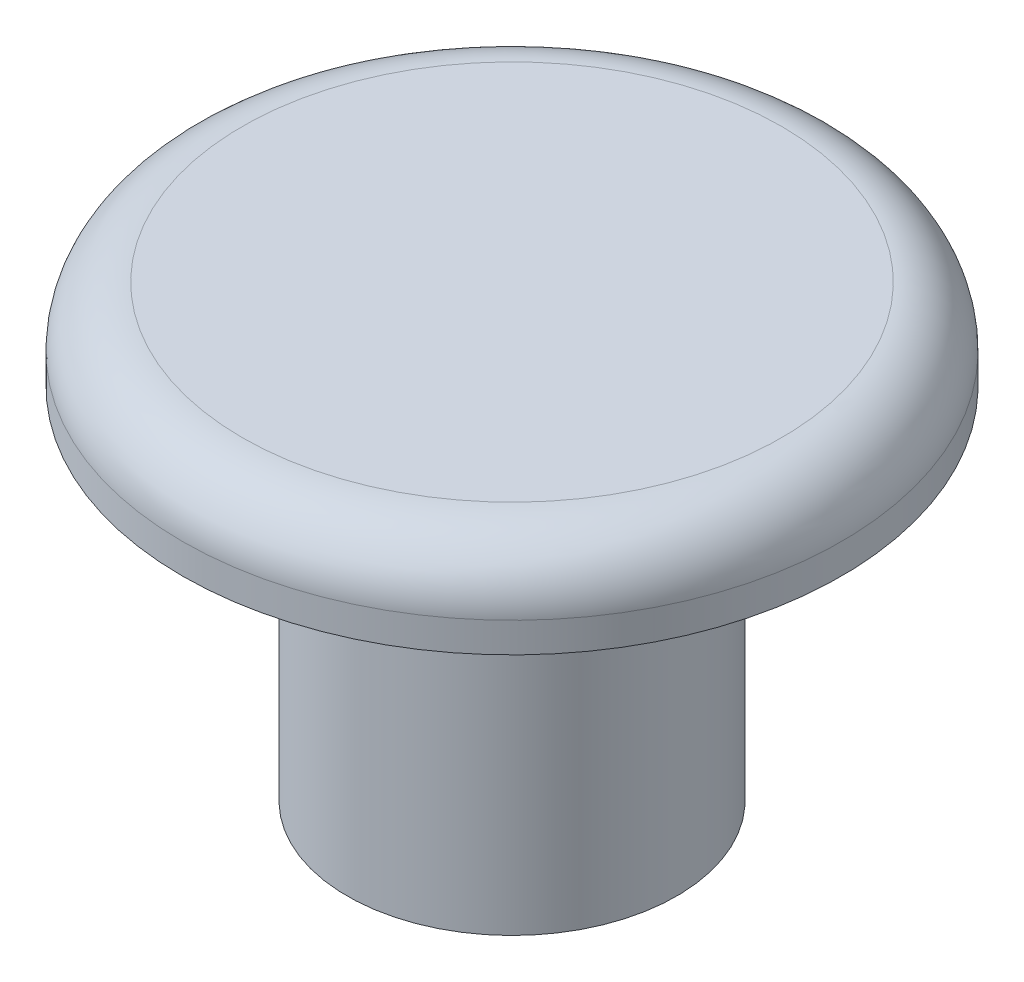
ISO-10303-21;
HEADER;
FILE_DESCRIPTION(('STEP AP214'),'2;1');
FILE_NAME('part.step','',(''),(''),'','','');
FILE_SCHEMA(('AUTOMOTIVE_DESIGN { 1 0 10303 214 1 1 1 1 }'));
ENDSEC;
DATA;
#1=APPLICATION_CONTEXT('core data for automotive mechanical design processes');
#2=APPLICATION_PROTOCOL_DEFINITION('international standard','automotive_design',2000,#1);
#3=PRODUCT_CONTEXT('',#1,'mechanical');
#4=PRODUCT('Part','Part','',(#3));
#5=PRODUCT_RELATED_PRODUCT_CATEGORY('part','',(#4));
#6=PRODUCT_DEFINITION_FORMATION('','',#4);
#7=PRODUCT_DEFINITION_CONTEXT('part definition',#1,'design');
#8=PRODUCT_DEFINITION('design','',#6,#7);
#9=PRODUCT_DEFINITION_SHAPE('','',#8);
#10=(LENGTH_UNIT() NAMED_UNIT(*) SI_UNIT(.MILLI.,.METRE.));
#11=(NAMED_UNIT(*) PLANE_ANGLE_UNIT() SI_UNIT($,.RADIAN.));
#12=(NAMED_UNIT(*) SI_UNIT($,.STERADIAN.) SOLID_ANGLE_UNIT());
#13=UNCERTAINTY_MEASURE_WITH_UNIT(LENGTH_MEASURE(1.E-05),#10,'distance_accuracy_value','');
#14=(GEOMETRIC_REPRESENTATION_CONTEXT(3) GLOBAL_UNCERTAINTY_ASSIGNED_CONTEXT((#13)) GLOBAL_UNIT_ASSIGNED_CONTEXT((#10,
#11,#12)) REPRESENTATION_CONTEXT('',''));
#15=CARTESIAN_POINT('',(0.,0.,0.));
#16=DIRECTION('',(0.,0.,1.));
#17=DIRECTION('',(1.,0.,0.));
#18=AXIS2_PLACEMENT_3D('',#15,#16,#17);
#19=CARTESIAN_POINT('',(0.,3.,0.));
#20=DIRECTION('',(0.,-1.,0.));
#21=DIRECTION('',(0.,0.,-1.));
#22=AXIS2_PLACEMENT_3D('',#19,#20,#21);
#23=CYLINDRICAL_SURFACE('',#22,11.);
#24=CARTESIAN_POINT('',(0.,1.,0.));
#25=DIRECTION('',(0.,1.,0.));
#26=DIRECTION('',(0.,0.,1.));
#27=AXIS2_PLACEMENT_3D('',#24,#25,#26);
#28=CIRCLE('',#27,11.);
#29=CARTESIAN_POINT('',(0.,1.,11.));
#30=VERTEX_POINT('',#29);
#31=EDGE_CURVE('E10',#30,#30,#28,.F.);
#32=ORIENTED_EDGE('',*,*,#31,.T.);
#33=EDGE_LOOP('',(#32));
#34=FACE_BOUND('',#33,.T.);
#35=CARTESIAN_POINT('',(0.,0.,0.));
#36=DIRECTION('',(0.,1.,0.));
#37=DIRECTION('',(0.,0.,1.));
#38=AXIS2_PLACEMENT_3D('',#35,#36,#37);
#39=CIRCLE('',#38,11.);
#40=CARTESIAN_POINT('',(0.,0.,11.));
#41=VERTEX_POINT('',#40);
#42=EDGE_CURVE('E55',#41,#41,#39,.T.);
#43=ORIENTED_EDGE('',*,*,#42,.T.);
#44=EDGE_LOOP('',(#43));
#45=FACE_BOUND('',#44,.T.);
#46=ADVANCED_FACE('F37',(#34,#45),#23,.T.);
#47=CARTESIAN_POINT('',(0.,3.,0.));
#48=DIRECTION('',(0.,1.,0.));
#49=DIRECTION('',(0.,0.,1.));
#50=AXIS2_PLACEMENT_3D('',#47,#48,#49);
#51=PLANE('',#50);
#52=CARTESIAN_POINT('',(0.,3.,0.));
#53=DIRECTION('',(0.,1.,0.));
#54=DIRECTION('',(0.,0.,1.));
#55=AXIS2_PLACEMENT_3D('',#52,#53,#54);
#56=CIRCLE('',#55,9.);
#57=CARTESIAN_POINT('',(0.,3.,9.));
#58=VERTEX_POINT('',#57);
#59=EDGE_CURVE('E45',#58,#58,#56,.T.);
#60=ORIENTED_EDGE('',*,*,#59,.T.);
#61=EDGE_LOOP('',(#60));
#62=FACE_BOUND('',#61,.T.);
#63=ADVANCED_FACE('F77',(#62),#51,.T.);
#64=CARTESIAN_POINT('',(0.,0.,0.));
#65=DIRECTION('',(0.,1.,0.));
#66=DIRECTION('',(0.,0.,1.));
#67=AXIS2_PLACEMENT_3D('',#64,#65,#66);
#68=PLANE('',#67);
#69=CARTESIAN_POINT('',(0.,0.,0.));
#70=DIRECTION('',(0.,-1.,0.));
#71=DIRECTION('',(0.,0.,-1.));
#72=AXIS2_PLACEMENT_3D('',#69,#70,#71);
#73=CIRCLE('',#72,5.5);
#74=CARTESIAN_POINT('',(0.,0.,-5.5));
#75=VERTEX_POINT('',#74);
#76=EDGE_CURVE('E50',#75,#75,#73,.T.);
#77=ORIENTED_EDGE('',*,*,#76,.F.);
#78=EDGE_LOOP('',(#77));
#79=FACE_BOUND('',#78,.T.);
#80=ORIENTED_EDGE('',*,*,#42,.F.);
#81=EDGE_LOOP('',(#80));
#82=FACE_BOUND('',#81,.T.);
#83=ADVANCED_FACE('F71',(#79,#82),#68,.F.);
#84=CARTESIAN_POINT('',(0.,-12.,0.));
#85=DIRECTION('',(0.,1.,0.));
#86=DIRECTION('',(0.,0.,1.));
#87=AXIS2_PLACEMENT_3D('',#84,#85,#86);
#88=CYLINDRICAL_SURFACE('',#87,5.5);
#89=CARTESIAN_POINT('',(0.,-12.,0.));
#90=DIRECTION('',(0.,-1.,0.));
#91=DIRECTION('',(0.,0.,-1.));
#92=AXIS2_PLACEMENT_3D('',#89,#90,#91);
#93=CIRCLE('',#92,5.5);
#94=CARTESIAN_POINT('',(0.,-12.,-5.5));
#95=VERTEX_POINT('',#94);
#96=EDGE_CURVE('E60',#95,#95,#93,.T.);
#97=ORIENTED_EDGE('',*,*,#96,.F.);
#98=EDGE_LOOP('',(#97));
#99=FACE_BOUND('',#98,.T.);
#100=ORIENTED_EDGE('',*,*,#76,.T.);
#101=EDGE_LOOP('',(#100));
#102=FACE_BOUND('',#101,.T.);
#103=ADVANCED_FACE('F68',(#99,#102),#88,.T.);
#104=CARTESIAN_POINT('',(0.,-12.,0.));
#105=DIRECTION('',(0.,-1.,0.));
#106=DIRECTION('',(0.,0.,-1.));
#107=AXIS2_PLACEMENT_3D('',#104,#105,#106);
#108=PLANE('',#107);
#109=ORIENTED_EDGE('',*,*,#96,.T.);
#110=EDGE_LOOP('',(#109));
#111=FACE_BOUND('',#110,.T.);
#112=ADVANCED_FACE('F66',(#111),#108,.T.);
#113=CARTESIAN_POINT('',(0.,1.,0.));
#114=DIRECTION('',(0.,1.,0.));
#115=DIRECTION('',(0.,0.,1.));
#116=AXIS2_PLACEMENT_3D('',#113,#114,#115);
#117=TOROIDAL_SURFACE('',#116,9.,2.);
#118=ORIENTED_EDGE('',*,*,#31,.F.);
#119=EDGE_LOOP('',(#118));
#120=FACE_BOUND('',#119,.T.);
#121=ORIENTED_EDGE('',*,*,#59,.F.);
#122=EDGE_LOOP('',(#121));
#123=FACE_BOUND('',#122,.T.);
#124=ADVANCED_FACE('F39',(#120,#123),#117,.T.);
#125=CLOSED_SHELL('',(#46,#63,#83,#103,#112,#124));
#126=MANIFOLD_SOLID_BREP('B2',#125);
#127=ADVANCED_BREP_SHAPE_REPRESENTATION('',(#18,#126),#14);
#128=SHAPE_DEFINITION_REPRESENTATION(#9,#127);
ENDSEC;
END-ISO-10303-21;
